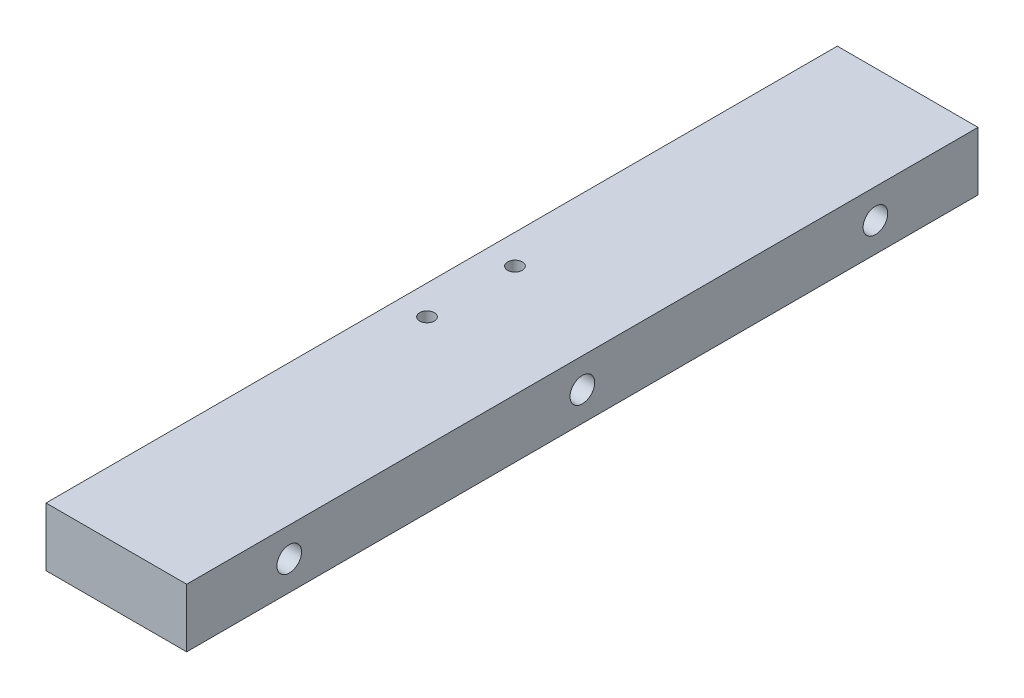
ISO-10303-21;
HEADER;
FILE_DESCRIPTION(('STEP AP214'),'2;1');
FILE_NAME('part.step','',(''),(''),'','','');
FILE_SCHEMA(('AUTOMOTIVE_DESIGN { 1 0 10303 214 1 1 1 1 }'));
ENDSEC;
DATA;
#1=APPLICATION_CONTEXT('core data for automotive mechanical design processes');
#2=APPLICATION_PROTOCOL_DEFINITION('international standard','automotive_design',2000,#1);
#3=PRODUCT_CONTEXT('',#1,'mechanical');
#4=PRODUCT('Part','Part','',(#3));
#5=PRODUCT_RELATED_PRODUCT_CATEGORY('part','',(#4));
#6=PRODUCT_DEFINITION_FORMATION('','',#4);
#7=PRODUCT_DEFINITION_CONTEXT('part definition',#1,'design');
#8=PRODUCT_DEFINITION('design','',#6,#7);
#9=PRODUCT_DEFINITION_SHAPE('','',#8);
#10=(LENGTH_UNIT() NAMED_UNIT(*) SI_UNIT(.MILLI.,.METRE.));
#11=(NAMED_UNIT(*) PLANE_ANGLE_UNIT() SI_UNIT($,.RADIAN.));
#12=(NAMED_UNIT(*) SI_UNIT($,.STERADIAN.) SOLID_ANGLE_UNIT());
#13=UNCERTAINTY_MEASURE_WITH_UNIT(LENGTH_MEASURE(1.E-05),#10,'distance_accuracy_value','');
#14=(GEOMETRIC_REPRESENTATION_CONTEXT(3) GLOBAL_UNCERTAINTY_ASSIGNED_CONTEXT((#13)) GLOBAL_UNIT_ASSIGNED_CONTEXT((#10,
#11,#12)) REPRESENTATION_CONTEXT('',''));
#15=CARTESIAN_POINT('',(0.,0.,0.));
#16=DIRECTION('',(0.,0.,1.));
#17=DIRECTION('',(1.,0.,0.));
#18=AXIS2_PLACEMENT_3D('',#15,#16,#17);
#19=CARTESIAN_POINT('',(0.,0.,-67.5));
#20=DIRECTION('',(0.,-1.,0.));
#21=DIRECTION('',(0.,0.,-1.));
#22=AXIS2_PLACEMENT_3D('',#19,#20,#21);
#23=PLANE('',#22);
#24=CARTESIAN_POINT('',(5.,0.,-7.5));
#25=DIRECTION('',(0.,1.,0.));
#26=DIRECTION('',(0.,0.,1.));
#27=AXIS2_PLACEMENT_3D('',#24,#25,#26);
#28=CIRCLE('',#27,1.25);
#29=CARTESIAN_POINT('',(5.,0.,-6.25));
#30=VERTEX_POINT('',#29);
#31=EDGE_CURVE('E140',#30,#30,#28,.T.);
#32=ORIENTED_EDGE('',*,*,#31,.T.);
#33=EDGE_LOOP('',(#32));
#34=FACE_BOUND('',#33,.T.);
#35=DIRECTION('',(0.,0.,1.));
#36=VECTOR('',#35,1.);
#37=CARTESIAN_POINT('',(0.,0.,67.5));
#38=LINE('',#37,#36);
#39=CARTESIAN_POINT('',(0.,0.,-67.5));
#40=VERTEX_POINT('',#39);
#41=CARTESIAN_POINT('',(0.,0.,67.5));
#42=VERTEX_POINT('',#41);
#43=EDGE_CURVE('E102',#40,#42,#38,.T.);
#44=ORIENTED_EDGE('',*,*,#43,.F.);
#45=DIRECTION('',(-1.,0.,0.));
#46=VECTOR('',#45,1.);
#47=CARTESIAN_POINT('',(0.,0.,-67.5));
#48=LINE('',#47,#46);
#49=CARTESIAN_POINT('',(24.,0.,-67.5));
#50=VERTEX_POINT('',#49);
#51=EDGE_CURVE('E78',#50,#40,#48,.T.);
#52=ORIENTED_EDGE('',*,*,#51,.F.);
#53=DIRECTION('',(0.,0.,-1.));
#54=VECTOR('',#53,1.);
#55=CARTESIAN_POINT('',(24.,0.,67.5));
#56=LINE('',#55,#54);
#57=CARTESIAN_POINT('',(24.,0.,67.5));
#58=VERTEX_POINT('',#57);
#59=EDGE_CURVE('E72',#58,#50,#56,.T.);
#60=ORIENTED_EDGE('',*,*,#59,.F.);
#61=DIRECTION('',(1.,0.,0.));
#62=VECTOR('',#61,1.);
#63=CARTESIAN_POINT('',(0.,0.,67.5));
#64=LINE('',#63,#62);
#65=EDGE_CURVE('E94',#42,#58,#64,.T.);
#66=ORIENTED_EDGE('',*,*,#65,.F.);
#67=EDGE_LOOP('',(#44,#52,#60,#66));
#68=FACE_BOUND('',#67,.T.);
#69=CARTESIAN_POINT('',(5.,0.,7.5));
#70=DIRECTION('',(0.,1.,0.));
#71=DIRECTION('',(0.,0.,1.));
#72=AXIS2_PLACEMENT_3D('',#69,#70,#71);
#73=CIRCLE('',#72,1.25);
#74=CARTESIAN_POINT('',(5.,0.,8.75));
#75=VERTEX_POINT('',#74);
#76=EDGE_CURVE('E134',#75,#75,#73,.T.);
#77=ORIENTED_EDGE('',*,*,#76,.T.);
#78=EDGE_LOOP('',(#77));
#79=FACE_BOUND('',#78,.T.);
#80=ADVANCED_FACE('F38',(#34,#68,#79),#23,.T.);
#81=CARTESIAN_POINT('',(0.,10.,67.5));
#82=DIRECTION('',(1.,0.,0.));
#83=DIRECTION('',(0.,0.,-1.));
#84=AXIS2_PLACEMENT_3D('',#81,#82,#83);
#85=PLANE('',#84);
#86=CARTESIAN_POINT('',(0.,5.,50.));
#87=DIRECTION('',(-1.,0.,0.));
#88=DIRECTION('',(0.,0.,1.));
#89=AXIS2_PLACEMENT_3D('',#86,#87,#88);
#90=CIRCLE('',#89,2.09999999999999);
#91=CARTESIAN_POINT('',(0.,5.,52.1));
#92=VERTEX_POINT('',#91);
#93=EDGE_CURVE('E131',#92,#92,#90,.T.);
#94=ORIENTED_EDGE('',*,*,#93,.F.);
#95=EDGE_LOOP('',(#94));
#96=FACE_BOUND('',#95,.T.);
#97=CARTESIAN_POINT('',(0.,5.,0.));
#98=DIRECTION('',(-1.,0.,0.));
#99=DIRECTION('',(0.,0.,1.));
#100=AXIS2_PLACEMENT_3D('',#97,#98,#99);
#101=CIRCLE('',#100,2.09999999999999);
#102=CARTESIAN_POINT('',(0.,5.,2.09999999999999));
#103=VERTEX_POINT('',#102);
#104=EDGE_CURVE('E128',#103,#103,#101,.T.);
#105=ORIENTED_EDGE('',*,*,#104,.F.);
#106=EDGE_LOOP('',(#105));
#107=FACE_BOUND('',#106,.T.);
#108=CARTESIAN_POINT('',(0.,5.00000000000001,-50.));
#109=DIRECTION('',(-1.,0.,0.));
#110=DIRECTION('',(0.,0.,1.));
#111=AXIS2_PLACEMENT_3D('',#108,#109,#110);
#112=CIRCLE('',#111,2.09999999999999);
#113=CARTESIAN_POINT('',(0.,5.00000000000001,-47.9));
#114=VERTEX_POINT('',#113);
#115=EDGE_CURVE('E125',#114,#114,#112,.T.);
#116=ORIENTED_EDGE('',*,*,#115,.F.);
#117=EDGE_LOOP('',(#116));
#118=FACE_BOUND('',#117,.T.);
#119=ORIENTED_EDGE('',*,*,#43,.T.);
#120=DIRECTION('',(0.,-1.,0.));
#121=VECTOR('',#120,1.);
#122=CARTESIAN_POINT('',(0.,10.,67.5));
#123=LINE('',#122,#121);
#124=CARTESIAN_POINT('',(0.,10.,67.5));
#125=VERTEX_POINT('',#124);
#126=EDGE_CURVE('E11',#125,#42,#123,.T.);
#127=ORIENTED_EDGE('',*,*,#126,.F.);
#128=DIRECTION('',(0.,0.,1.));
#129=VECTOR('',#128,1.);
#130=CARTESIAN_POINT('',(0.,10.,67.5));
#131=LINE('',#130,#129);
#132=CARTESIAN_POINT('',(0.,10.,-67.5));
#133=VERTEX_POINT('',#132);
#134=EDGE_CURVE('E90',#133,#125,#131,.T.);
#135=ORIENTED_EDGE('',*,*,#134,.F.);
#136=DIRECTION('',(0.,-1.,0.));
#137=VECTOR('',#136,1.);
#138=CARTESIAN_POINT('',(0.,10.,-67.5));
#139=LINE('',#138,#137);
#140=EDGE_CURVE('E98',#133,#40,#139,.T.);
#141=ORIENTED_EDGE('',*,*,#140,.T.);
#142=EDGE_LOOP('',(#119,#127,#135,#141));
#143=FACE_BOUND('',#142,.T.);
#144=ADVANCED_FACE('F40',(#96,#107,#118,#143),#85,.F.);
#145=CARTESIAN_POINT('',(0.,10.,67.5));
#146=DIRECTION('',(0.,0.,-1.));
#147=DIRECTION('',(-1.,0.,0.));
#148=AXIS2_PLACEMENT_3D('',#145,#146,#147);
#149=PLANE('',#148);
#150=ORIENTED_EDGE('',*,*,#65,.T.);
#151=DIRECTION('',(0.,-1.,0.));
#152=VECTOR('',#151,1.);
#153=CARTESIAN_POINT('',(24.,10.,67.5));
#154=LINE('',#153,#152);
#155=CARTESIAN_POINT('',(24.,10.,67.5));
#156=VERTEX_POINT('',#155);
#157=EDGE_CURVE('E47',#156,#58,#154,.T.);
#158=ORIENTED_EDGE('',*,*,#157,.F.);
#159=DIRECTION('',(1.,0.,0.));
#160=VECTOR('',#159,1.);
#161=CARTESIAN_POINT('',(0.,10.,67.5));
#162=LINE('',#161,#160);
#163=EDGE_CURVE('E85',#125,#156,#162,.T.);
#164=ORIENTED_EDGE('',*,*,#163,.F.);
#165=ORIENTED_EDGE('',*,*,#126,.T.);
#166=EDGE_LOOP('',(#150,#158,#164,#165));
#167=FACE_BOUND('',#166,.T.);
#168=ADVANCED_FACE('F93',(#167),#149,.F.);
#169=CARTESIAN_POINT('',(24.,10.,67.5));
#170=DIRECTION('',(-1.,0.,0.));
#171=DIRECTION('',(0.,0.,1.));
#172=AXIS2_PLACEMENT_3D('',#169,#170,#171);
#173=PLANE('',#172);
#174=CARTESIAN_POINT('',(24.,5.,0.));
#175=DIRECTION('',(1.,0.,0.));
#176=DIRECTION('',(0.,0.,-1.));
#177=AXIS2_PLACEMENT_3D('',#174,#175,#176);
#178=CIRCLE('',#177,2.1);
#179=CARTESIAN_POINT('',(24.,5.,-2.1));
#180=VERTEX_POINT('',#179);
#181=EDGE_CURVE('E122',#180,#180,#178,.T.);
#182=ORIENTED_EDGE('',*,*,#181,.F.);
#183=EDGE_LOOP('',(#182));
#184=FACE_BOUND('',#183,.T.);
#185=CARTESIAN_POINT('',(24.,5.,50.));
#186=DIRECTION('',(1.,0.,0.));
#187=DIRECTION('',(0.,0.,-1.));
#188=AXIS2_PLACEMENT_3D('',#185,#186,#187);
#189=CIRCLE('',#188,2.1);
#190=CARTESIAN_POINT('',(24.,5.,47.9));
#191=VERTEX_POINT('',#190);
#192=EDGE_CURVE('E118',#191,#191,#189,.T.);
#193=ORIENTED_EDGE('',*,*,#192,.F.);
#194=EDGE_LOOP('',(#193));
#195=FACE_BOUND('',#194,.T.);
#196=CARTESIAN_POINT('',(24.,5.00000000000001,-50.));
#197=DIRECTION('',(1.,0.,0.));
#198=DIRECTION('',(0.,0.,-1.));
#199=AXIS2_PLACEMENT_3D('',#196,#197,#198);
#200=CIRCLE('',#199,2.1);
#201=CARTESIAN_POINT('',(24.,5.00000000000001,-52.1));
#202=VERTEX_POINT('',#201);
#203=EDGE_CURVE('E105',#202,#202,#200,.T.);
#204=ORIENTED_EDGE('',*,*,#203,.F.);
#205=EDGE_LOOP('',(#204));
#206=FACE_BOUND('',#205,.T.);
#207=ORIENTED_EDGE('',*,*,#59,.T.);
#208=DIRECTION('',(0.,-1.,0.));
#209=VECTOR('',#208,1.);
#210=CARTESIAN_POINT('',(24.,10.,-67.5));
#211=LINE('',#210,#209);
#212=CARTESIAN_POINT('',(24.,10.,-67.5));
#213=VERTEX_POINT('',#212);
#214=EDGE_CURVE('E95',#213,#50,#211,.T.);
#215=ORIENTED_EDGE('',*,*,#214,.F.);
#216=DIRECTION('',(0.,0.,-1.));
#217=VECTOR('',#216,1.);
#218=CARTESIAN_POINT('',(24.,10.,67.5));
#219=LINE('',#218,#217);
#220=EDGE_CURVE('E88',#156,#213,#219,.T.);
#221=ORIENTED_EDGE('',*,*,#220,.F.);
#222=ORIENTED_EDGE('',*,*,#157,.T.);
#223=EDGE_LOOP('',(#207,#215,#221,#222));
#224=FACE_BOUND('',#223,.T.);
#225=ADVANCED_FACE('F96',(#184,#195,#206,#224),#173,.F.);
#226=CARTESIAN_POINT('',(0.,10.,-67.5));
#227=DIRECTION('',(0.,0.,1.));
#228=DIRECTION('',(1.,0.,0.));
#229=AXIS2_PLACEMENT_3D('',#226,#227,#228);
#230=PLANE('',#229);
#231=ORIENTED_EDGE('',*,*,#51,.T.);
#232=ORIENTED_EDGE('',*,*,#140,.F.);
#233=DIRECTION('',(-1.,0.,0.));
#234=VECTOR('',#233,1.);
#235=CARTESIAN_POINT('',(0.,10.,-67.5));
#236=LINE('',#235,#234);
#237=EDGE_CURVE('E55',#213,#133,#236,.T.);
#238=ORIENTED_EDGE('',*,*,#237,.F.);
#239=ORIENTED_EDGE('',*,*,#214,.T.);
#240=EDGE_LOOP('',(#231,#232,#238,#239));
#241=FACE_BOUND('',#240,.T.);
#242=ADVANCED_FACE('F110',(#241),#230,.F.);
#243=CARTESIAN_POINT('',(0.,10.,-67.5));
#244=DIRECTION('',(0.,-1.,0.));
#245=DIRECTION('',(0.,0.,-1.));
#246=AXIS2_PLACEMENT_3D('',#243,#244,#245);
#247=PLANE('',#246);
#248=CARTESIAN_POINT('',(5.,10.,-7.5));
#249=DIRECTION('',(0.,1.,0.));
#250=DIRECTION('',(0.,0.,1.));
#251=AXIS2_PLACEMENT_3D('',#248,#249,#250);
#252=CIRCLE('',#251,1.24999999999999);
#253=CARTESIAN_POINT('',(5.,10.,-6.25000000000001));
#254=VERTEX_POINT('',#253);
#255=EDGE_CURVE('E143',#254,#254,#252,.T.);
#256=ORIENTED_EDGE('',*,*,#255,.F.);
#257=EDGE_LOOP('',(#256));
#258=FACE_BOUND('',#257,.T.);
#259=CARTESIAN_POINT('',(5.,10.,7.5));
#260=DIRECTION('',(0.,1.,0.));
#261=DIRECTION('',(0.,0.,1.));
#262=AXIS2_PLACEMENT_3D('',#259,#260,#261);
#263=CIRCLE('',#262,1.24999999999999);
#264=CARTESIAN_POINT('',(5.,10.,8.74999999999999));
#265=VERTEX_POINT('',#264);
#266=EDGE_CURVE('E137',#265,#265,#263,.T.);
#267=ORIENTED_EDGE('',*,*,#266,.F.);
#268=EDGE_LOOP('',(#267));
#269=FACE_BOUND('',#268,.T.);
#270=ORIENTED_EDGE('',*,*,#134,.T.);
#271=ORIENTED_EDGE('',*,*,#163,.T.);
#272=ORIENTED_EDGE('',*,*,#220,.T.);
#273=ORIENTED_EDGE('',*,*,#237,.T.);
#274=EDGE_LOOP('',(#270,#271,#272,#273));
#275=FACE_BOUND('',#274,.T.);
#276=ADVANCED_FACE('F86',(#258,#269,#275),#247,.F.);
#277=CARTESIAN_POINT('',(24.,5.00000000000001,-50.));
#278=DIRECTION('',(1.,0.,0.));
#279=DIRECTION('',(0.,0.,-1.));
#280=AXIS2_PLACEMENT_3D('',#277,#278,#279);
#281=CYLINDRICAL_SURFACE('',#280,2.1);
#282=ORIENTED_EDGE('',*,*,#203,.T.);
#283=EDGE_LOOP('',(#282));
#284=FACE_BOUND('',#283,.T.);
#285=ORIENTED_EDGE('',*,*,#115,.T.);
#286=EDGE_LOOP('',(#285));
#287=FACE_BOUND('',#286,.T.);
#288=ADVANCED_FACE('F151',(#284,#287),#281,.F.);
#289=CARTESIAN_POINT('',(24.,5.,50.));
#290=DIRECTION('',(1.,0.,0.));
#291=DIRECTION('',(0.,0.,-1.));
#292=AXIS2_PLACEMENT_3D('',#289,#290,#291);
#293=CYLINDRICAL_SURFACE('',#292,2.1);
#294=ORIENTED_EDGE('',*,*,#192,.T.);
#295=EDGE_LOOP('',(#294));
#296=FACE_BOUND('',#295,.T.);
#297=ORIENTED_EDGE('',*,*,#93,.T.);
#298=EDGE_LOOP('',(#297));
#299=FACE_BOUND('',#298,.T.);
#300=ADVANCED_FACE('F166',(#296,#299),#293,.F.);
#301=CARTESIAN_POINT('',(24.,5.,0.));
#302=DIRECTION('',(1.,0.,0.));
#303=DIRECTION('',(0.,0.,-1.));
#304=AXIS2_PLACEMENT_3D('',#301,#302,#303);
#305=CYLINDRICAL_SURFACE('',#304,2.1);
#306=ORIENTED_EDGE('',*,*,#181,.T.);
#307=EDGE_LOOP('',(#306));
#308=FACE_BOUND('',#307,.T.);
#309=ORIENTED_EDGE('',*,*,#104,.T.);
#310=EDGE_LOOP('',(#309));
#311=FACE_BOUND('',#310,.T.);
#312=ADVANCED_FACE('F157',(#308,#311),#305,.F.);
#313=CARTESIAN_POINT('',(5.,10.,7.5));
#314=DIRECTION('',(0.,1.,0.));
#315=DIRECTION('',(0.,0.,1.));
#316=AXIS2_PLACEMENT_3D('',#313,#314,#315);
#317=CYLINDRICAL_SURFACE('',#316,1.24999999999999);
#318=ORIENTED_EDGE('',*,*,#76,.F.);
#319=EDGE_LOOP('',(#318));
#320=FACE_BOUND('',#319,.T.);
#321=ORIENTED_EDGE('',*,*,#266,.T.);
#322=EDGE_LOOP('',(#321));
#323=FACE_BOUND('',#322,.T.);
#324=ADVANCED_FACE('F155',(#320,#323),#317,.F.);
#325=CARTESIAN_POINT('',(5.,10.,-7.5));
#326=DIRECTION('',(0.,1.,0.));
#327=DIRECTION('',(0.,0.,1.));
#328=AXIS2_PLACEMENT_3D('',#325,#326,#327);
#329=CYLINDRICAL_SURFACE('',#328,1.24999999999999);
#330=ORIENTED_EDGE('',*,*,#31,.F.);
#331=EDGE_LOOP('',(#330));
#332=FACE_BOUND('',#331,.T.);
#333=ORIENTED_EDGE('',*,*,#255,.T.);
#334=EDGE_LOOP('',(#333));
#335=FACE_BOUND('',#334,.T.);
#336=ADVANCED_FACE('F147',(#332,#335),#329,.F.);
#337=CLOSED_SHELL('',(#80,#144,#168,#225,#242,#276,#288,#300,#312,#324,#336));
#338=MANIFOLD_SOLID_BREP('B2',#337);
#339=ADVANCED_BREP_SHAPE_REPRESENTATION('',(#18,#338),#14);
#340=SHAPE_DEFINITION_REPRESENTATION(#9,#339);
ENDSEC;
END-ISO-10303-21;
